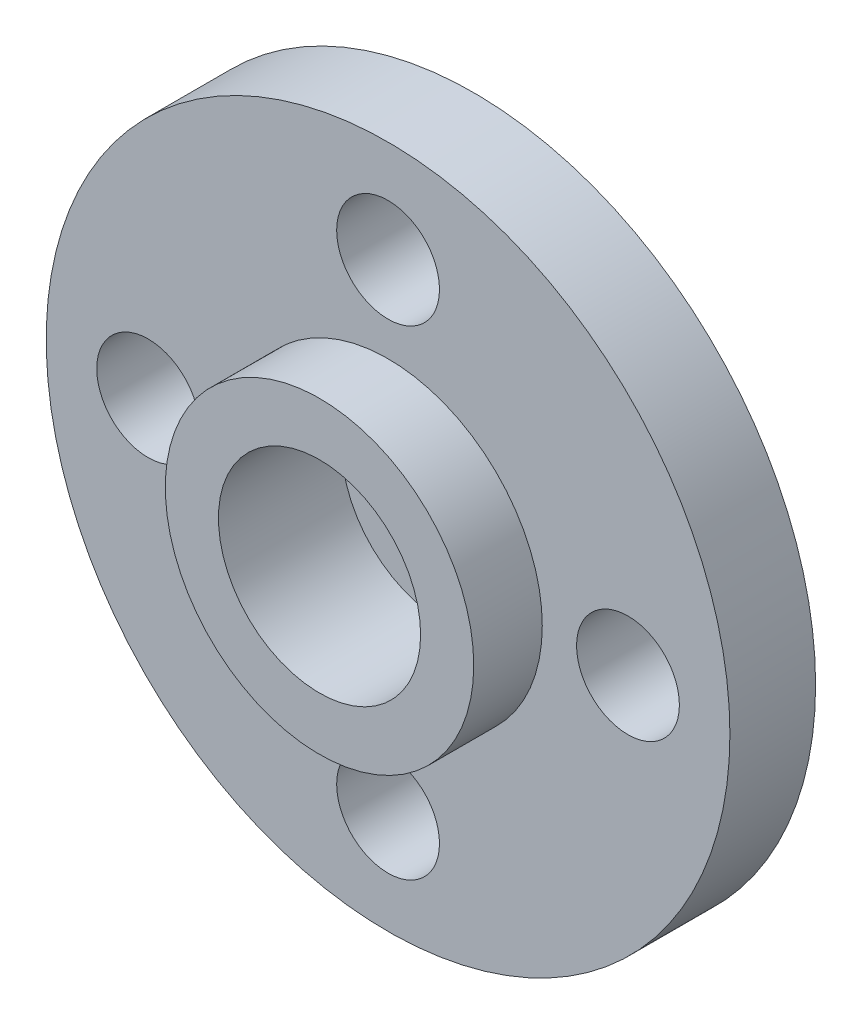
ISO-10303-21;
HEADER;
FILE_DESCRIPTION(('STEP AP214'),'2;1');
FILE_NAME('part.step','',(''),(''),'','','');
FILE_SCHEMA(('AUTOMOTIVE_DESIGN { 1 0 10303 214 1 1 1 1 }'));
ENDSEC;
DATA;
#1=APPLICATION_CONTEXT('core data for automotive mechanical design processes');
#2=APPLICATION_PROTOCOL_DEFINITION('international standard','automotive_design',2000,#1);
#3=PRODUCT_CONTEXT('',#1,'mechanical');
#4=PRODUCT('Part','Part','',(#3));
#5=PRODUCT_RELATED_PRODUCT_CATEGORY('part','',(#4));
#6=PRODUCT_DEFINITION_FORMATION('','',#4);
#7=PRODUCT_DEFINITION_CONTEXT('part definition',#1,'design');
#8=PRODUCT_DEFINITION('design','',#6,#7);
#9=PRODUCT_DEFINITION_SHAPE('','',#8);
#10=(LENGTH_UNIT() NAMED_UNIT(*) SI_UNIT(.MILLI.,.METRE.));
#11=(NAMED_UNIT(*) PLANE_ANGLE_UNIT() SI_UNIT($,.RADIAN.));
#12=(NAMED_UNIT(*) SI_UNIT($,.STERADIAN.) SOLID_ANGLE_UNIT());
#13=UNCERTAINTY_MEASURE_WITH_UNIT(LENGTH_MEASURE(1.E-05),#10,'distance_accuracy_value','');
#14=(GEOMETRIC_REPRESENTATION_CONTEXT(3) GLOBAL_UNCERTAINTY_ASSIGNED_CONTEXT((#13)) GLOBAL_UNIT_ASSIGNED_CONTEXT((#10,
#11,#12)) REPRESENTATION_CONTEXT('',''));
#15=CARTESIAN_POINT('',(0.,0.,0.));
#16=DIRECTION('',(0.,0.,1.));
#17=DIRECTION('',(1.,0.,0.));
#18=AXIS2_PLACEMENT_3D('',#15,#16,#17);
#19=CARTESIAN_POINT('',(0.,0.,-0.899999999999998));
#20=DIRECTION('',(0.,0.,1.));
#21=DIRECTION('',(1.,0.,0.));
#22=AXIS2_PLACEMENT_3D('',#19,#20,#21);
#23=PLANE('',#22);
#24=CARTESIAN_POINT('',(0.,0.,-0.899999999999998));
#25=DIRECTION('',(0.,0.,1.));
#26=DIRECTION('',(1.,0.,0.));
#27=AXIS2_PLACEMENT_3D('',#24,#25,#26);
#28=CIRCLE('',#27,1.6);
#29=CARTESIAN_POINT('',(1.6,0.,-0.899999999999998));
#30=VERTEX_POINT('',#29);
#31=EDGE_CURVE('E80',#30,#30,#28,.T.);
#32=ORIENTED_EDGE('',*,*,#31,.T.);
#33=EDGE_LOOP('',(#32));
#34=FACE_BOUND('',#33,.T.);
#35=CARTESIAN_POINT('',(0.,0.,-0.899999999999998));
#36=DIRECTION('',(0.,0.,1.));
#37=DIRECTION('',(1.,0.,0.));
#38=AXIS2_PLACEMENT_3D('',#35,#36,#37);
#39=CIRCLE('',#38,9.975);
#40=CARTESIAN_POINT('',(9.975,0.,-0.899999999999998));
#41=VERTEX_POINT('',#40);
#42=EDGE_CURVE('E75',#41,#41,#39,.T.);
#43=ORIENTED_EDGE('',*,*,#42,.F.);
#44=EDGE_LOOP('',(#43));
#45=FACE_BOUND('',#44,.T.);
#46=CARTESIAN_POINT('',(7.,0.,-0.899999999999999));
#47=DIRECTION('',(0.,0.,-1.));
#48=DIRECTION('',(-1.,0.,0.));
#49=AXIS2_PLACEMENT_3D('',#46,#47,#48);
#50=CIRCLE('',#49,1.49999999999999);
#51=CARTESIAN_POINT('',(5.50000000000001,0.,-0.899999999999999));
#52=VERTEX_POINT('',#51);
#53=EDGE_CURVE('E95',#52,#52,#50,.T.);
#54=ORIENTED_EDGE('',*,*,#53,.F.);
#55=EDGE_LOOP('',(#54));
#56=FACE_BOUND('',#55,.T.);
#57=CARTESIAN_POINT('',(0.,-7.,-0.899999999999999));
#58=DIRECTION('',(0.,0.,-1.));
#59=DIRECTION('',(-1.,0.,0.));
#60=AXIS2_PLACEMENT_3D('',#57,#58,#59);
#61=CIRCLE('',#60,1.49999999999999);
#62=CARTESIAN_POINT('',(-1.49999999999999,-7.,-0.899999999999999));
#63=VERTEX_POINT('',#62);
#64=EDGE_CURVE('E103',#63,#63,#61,.T.);
#65=ORIENTED_EDGE('',*,*,#64,.F.);
#66=EDGE_LOOP('',(#65));
#67=FACE_BOUND('',#66,.T.);
#68=CARTESIAN_POINT('',(-7.,0.,-0.899999999999999));
#69=DIRECTION('',(0.,0.,-1.));
#70=DIRECTION('',(-1.,0.,0.));
#71=AXIS2_PLACEMENT_3D('',#68,#69,#70);
#72=CIRCLE('',#71,1.49999999999999);
#73=CARTESIAN_POINT('',(-8.49999999999999,0.,-0.899999999999999));
#74=VERTEX_POINT('',#73);
#75=EDGE_CURVE('E111',#74,#74,#72,.T.);
#76=ORIENTED_EDGE('',*,*,#75,.F.);
#77=EDGE_LOOP('',(#76));
#78=FACE_BOUND('',#77,.T.);
#79=CARTESIAN_POINT('',(0.,7.,-0.899999999999999));
#80=DIRECTION('',(0.,0.,-1.));
#81=DIRECTION('',(-1.,0.,0.));
#82=AXIS2_PLACEMENT_3D('',#79,#80,#81);
#83=CIRCLE('',#82,1.49999999999999);
#84=CARTESIAN_POINT('',(-1.49999999999999,7.,-0.899999999999999));
#85=VERTEX_POINT('',#84);
#86=EDGE_CURVE('E119',#85,#85,#83,.T.);
#87=ORIENTED_EDGE('',*,*,#86,.F.);
#88=EDGE_LOOP('',(#87));
#89=FACE_BOUND('',#88,.T.);
#90=ADVANCED_FACE('F55',(#34,#45,#56,#67,#78,#89),#23,.F.);
#91=CARTESIAN_POINT('',(0.,0.,-0.899999999999998));
#92=DIRECTION('',(0.,0.,1.));
#93=DIRECTION('',(1.,0.,0.));
#94=AXIS2_PLACEMENT_3D('',#91,#92,#93);
#95=CYLINDRICAL_SURFACE('',#94,1.6);
#96=ORIENTED_EDGE('',*,*,#31,.F.);
#97=EDGE_LOOP('',(#96));
#98=FACE_BOUND('',#97,.T.);
#99=CARTESIAN_POINT('',(0.,0.,0.));
#100=DIRECTION('',(0.,0.,1.));
#101=DIRECTION('',(1.,0.,0.));
#102=AXIS2_PLACEMENT_3D('',#99,#100,#101);
#103=CIRCLE('',#102,1.6);
#104=CARTESIAN_POINT('',(1.6,0.,0.));
#105=VERTEX_POINT('',#104);
#106=EDGE_CURVE('E59',#105,#105,#103,.F.);
#107=ORIENTED_EDGE('',*,*,#106,.F.);
#108=EDGE_LOOP('',(#107));
#109=FACE_BOUND('',#108,.T.);
#110=ADVANCED_FACE('F128',(#98,#109),#95,.F.);
#111=CARTESIAN_POINT('',(0.,0.,3.6));
#112=DIRECTION('',(0.,0.,1.));
#113=DIRECTION('',(1.,0.,0.));
#114=AXIS2_PLACEMENT_3D('',#111,#112,#113);
#115=PLANE('',#114);
#116=CARTESIAN_POINT('',(0.,0.,3.6));
#117=DIRECTION('',(0.,0.,1.));
#118=DIRECTION('',(1.,0.,0.));
#119=AXIS2_PLACEMENT_3D('',#116,#117,#118);
#120=CIRCLE('',#119,4.5);
#121=CARTESIAN_POINT('',(4.5,0.,3.6));
#122=VERTEX_POINT('',#121);
#123=EDGE_CURVE('E11',#122,#122,#120,.T.);
#124=ORIENTED_EDGE('',*,*,#123,.T.);
#125=EDGE_LOOP('',(#124));
#126=FACE_BOUND('',#125,.T.);
#127=CARTESIAN_POINT('',(0.,0.,3.6));
#128=DIRECTION('',(0.,0.,1.));
#129=DIRECTION('',(1.,0.,0.));
#130=AXIS2_PLACEMENT_3D('',#127,#128,#129);
#131=CIRCLE('',#130,2.95);
#132=CARTESIAN_POINT('',(2.95,0.,3.6));
#133=VERTEX_POINT('',#132);
#134=EDGE_CURVE('E64',#133,#133,#131,.T.);
#135=ORIENTED_EDGE('',*,*,#134,.F.);
#136=EDGE_LOOP('',(#135));
#137=FACE_BOUND('',#136,.T.);
#138=ADVANCED_FACE('F136',(#126,#137),#115,.T.);
#139=CARTESIAN_POINT('',(0.,0.,3.6));
#140=DIRECTION('',(0.,0.,-1.));
#141=DIRECTION('',(-1.,0.,0.));
#142=AXIS2_PLACEMENT_3D('',#139,#140,#141);
#143=CYLINDRICAL_SURFACE('',#142,4.5);
#144=CARTESIAN_POINT('',(0.,0.,1.6));
#145=DIRECTION('',(0.,0.,1.));
#146=DIRECTION('',(1.,0.,0.));
#147=AXIS2_PLACEMENT_3D('',#144,#145,#146);
#148=CIRCLE('',#147,4.5);
#149=CARTESIAN_POINT('',(4.5,0.,1.6));
#150=VERTEX_POINT('',#149);
#151=EDGE_CURVE('E69',#150,#150,#148,.T.);
#152=ORIENTED_EDGE('',*,*,#151,.T.);
#153=EDGE_LOOP('',(#152));
#154=FACE_BOUND('',#153,.T.);
#155=ORIENTED_EDGE('',*,*,#123,.F.);
#156=EDGE_LOOP('',(#155));
#157=FACE_BOUND('',#156,.T.);
#158=ADVANCED_FACE('F57',(#154,#157),#143,.T.);
#159=CARTESIAN_POINT('',(0.,0.,3.6));
#160=DIRECTION('',(0.,0.,-1.));
#161=DIRECTION('',(-1.,0.,0.));
#162=AXIS2_PLACEMENT_3D('',#159,#160,#161);
#163=CYLINDRICAL_SURFACE('',#162,2.95);
#164=ORIENTED_EDGE('',*,*,#134,.T.);
#165=EDGE_LOOP('',(#164));
#166=FACE_BOUND('',#165,.T.);
#167=CARTESIAN_POINT('',(0.,0.,0.));
#168=DIRECTION('',(0.,0.,1.));
#169=DIRECTION('',(1.,0.,0.));
#170=AXIS2_PLACEMENT_3D('',#167,#168,#169);
#171=CIRCLE('',#170,2.95);
#172=CARTESIAN_POINT('',(2.95,0.,0.));
#173=VERTEX_POINT('',#172);
#174=EDGE_CURVE('E87',#173,#173,#171,.T.);
#175=ORIENTED_EDGE('',*,*,#174,.F.);
#176=EDGE_LOOP('',(#175));
#177=FACE_BOUND('',#176,.T.);
#178=ADVANCED_FACE('F149',(#166,#177),#163,.F.);
#179=CARTESIAN_POINT('',(0.,0.,-0.899999999999998));
#180=DIRECTION('',(0.,0.,1.));
#181=DIRECTION('',(1.,0.,0.));
#182=AXIS2_PLACEMENT_3D('',#179,#180,#181);
#183=CYLINDRICAL_SURFACE('',#182,9.975);
#184=ORIENTED_EDGE('',*,*,#42,.T.);
#185=EDGE_LOOP('',(#184));
#186=FACE_BOUND('',#185,.T.);
#187=CARTESIAN_POINT('',(0.,0.,1.6));
#188=DIRECTION('',(0.,0.,1.));
#189=DIRECTION('',(1.,0.,0.));
#190=AXIS2_PLACEMENT_3D('',#187,#188,#189);
#191=CIRCLE('',#190,9.975);
#192=CARTESIAN_POINT('',(9.975,0.,1.6));
#193=VERTEX_POINT('',#192);
#194=EDGE_CURVE('E76',#193,#193,#191,.T.);
#195=ORIENTED_EDGE('',*,*,#194,.F.);
#196=EDGE_LOOP('',(#195));
#197=FACE_BOUND('',#196,.T.);
#198=ADVANCED_FACE('F145',(#186,#197),#183,.T.);
#199=CARTESIAN_POINT('',(0.,0.,1.6));
#200=DIRECTION('',(0.,0.,1.));
#201=DIRECTION('',(1.,0.,0.));
#202=AXIS2_PLACEMENT_3D('',#199,#200,#201);
#203=PLANE('',#202);
#204=CARTESIAN_POINT('',(0.,7.,1.6));
#205=DIRECTION('',(0.,0.,1.));
#206=DIRECTION('',(1.,0.,0.));
#207=AXIS2_PLACEMENT_3D('',#204,#205,#206);
#208=CIRCLE('',#207,1.49999999999999);
#209=CARTESIAN_POINT('',(1.49999999999999,7.,1.6));
#210=VERTEX_POINT('',#209);
#211=EDGE_CURVE('E115',#210,#210,#208,.T.);
#212=ORIENTED_EDGE('',*,*,#211,.F.);
#213=EDGE_LOOP('',(#212));
#214=FACE_BOUND('',#213,.T.);
#215=CARTESIAN_POINT('',(-7.,0.,1.6));
#216=DIRECTION('',(0.,0.,1.));
#217=DIRECTION('',(1.,0.,0.));
#218=AXIS2_PLACEMENT_3D('',#215,#216,#217);
#219=CIRCLE('',#218,1.49999999999999);
#220=CARTESIAN_POINT('',(-5.50000000000001,0.,1.6));
#221=VERTEX_POINT('',#220);
#222=EDGE_CURVE('E107',#221,#221,#219,.T.);
#223=ORIENTED_EDGE('',*,*,#222,.F.);
#224=EDGE_LOOP('',(#223));
#225=FACE_BOUND('',#224,.T.);
#226=CARTESIAN_POINT('',(0.,-7.,1.6));
#227=DIRECTION('',(0.,0.,1.));
#228=DIRECTION('',(1.,0.,0.));
#229=AXIS2_PLACEMENT_3D('',#226,#227,#228);
#230=CIRCLE('',#229,1.49999999999999);
#231=CARTESIAN_POINT('',(1.49999999999999,-7.,1.6));
#232=VERTEX_POINT('',#231);
#233=EDGE_CURVE('E99',#232,#232,#230,.T.);
#234=ORIENTED_EDGE('',*,*,#233,.F.);
#235=EDGE_LOOP('',(#234));
#236=FACE_BOUND('',#235,.T.);
#237=CARTESIAN_POINT('',(7.,0.,1.6));
#238=DIRECTION('',(0.,0.,1.));
#239=DIRECTION('',(1.,0.,0.));
#240=AXIS2_PLACEMENT_3D('',#237,#238,#239);
#241=CIRCLE('',#240,1.49999999999999);
#242=CARTESIAN_POINT('',(8.49999999999999,0.,1.6));
#243=VERTEX_POINT('',#242);
#244=EDGE_CURVE('E91',#243,#243,#241,.T.);
#245=ORIENTED_EDGE('',*,*,#244,.F.);
#246=EDGE_LOOP('',(#245));
#247=FACE_BOUND('',#246,.T.);
#248=ORIENTED_EDGE('',*,*,#151,.F.);
#249=EDGE_LOOP('',(#248));
#250=FACE_BOUND('',#249,.T.);
#251=ORIENTED_EDGE('',*,*,#194,.T.);
#252=EDGE_LOOP('',(#251));
#253=FACE_BOUND('',#252,.T.);
#254=ADVANCED_FACE('F142',(#214,#225,#236,#247,#250,#253),#203,.T.);
#255=CARTESIAN_POINT('',(0.,0.,0.));
#256=DIRECTION('',(0.,0.,1.));
#257=DIRECTION('',(1.,0.,0.));
#258=AXIS2_PLACEMENT_3D('',#255,#256,#257);
#259=PLANE('',#258);
#260=ORIENTED_EDGE('',*,*,#174,.T.);
#261=EDGE_LOOP('',(#260));
#262=FACE_BOUND('',#261,.T.);
#263=ORIENTED_EDGE('',*,*,#106,.T.);
#264=EDGE_LOOP('',(#263));
#265=FACE_BOUND('',#264,.T.);
#266=ADVANCED_FACE('F144',(#262,#265),#259,.T.);
#267=CARTESIAN_POINT('',(7.,0.,-0.899999999999998));
#268=DIRECTION('',(0.,0.,-1.));
#269=DIRECTION('',(-1.,0.,0.));
#270=AXIS2_PLACEMENT_3D('',#267,#268,#269);
#271=CYLINDRICAL_SURFACE('',#270,1.49999999999999);
#272=ORIENTED_EDGE('',*,*,#53,.T.);
#273=EDGE_LOOP('',(#272));
#274=FACE_BOUND('',#273,.T.);
#275=ORIENTED_EDGE('',*,*,#244,.T.);
#276=EDGE_LOOP('',(#275));
#277=FACE_BOUND('',#276,.T.);
#278=ADVANCED_FACE('F164',(#274,#277),#271,.F.);
#279=CARTESIAN_POINT('',(0.,-7.,-0.899999999999998));
#280=DIRECTION('',(0.,0.,-1.));
#281=DIRECTION('',(-1.,0.,0.));
#282=AXIS2_PLACEMENT_3D('',#279,#280,#281);
#283=CYLINDRICAL_SURFACE('',#282,1.49999999999999);
#284=ORIENTED_EDGE('',*,*,#64,.T.);
#285=EDGE_LOOP('',(#284));
#286=FACE_BOUND('',#285,.T.);
#287=ORIENTED_EDGE('',*,*,#233,.T.);
#288=EDGE_LOOP('',(#287));
#289=FACE_BOUND('',#288,.T.);
#290=ADVANCED_FACE('F172',(#286,#289),#283,.F.);
#291=CARTESIAN_POINT('',(-7.,0.,-0.899999999999998));
#292=DIRECTION('',(0.,0.,-1.));
#293=DIRECTION('',(-1.,0.,0.));
#294=AXIS2_PLACEMENT_3D('',#291,#292,#293);
#295=CYLINDRICAL_SURFACE('',#294,1.49999999999999);
#296=ORIENTED_EDGE('',*,*,#75,.T.);
#297=EDGE_LOOP('',(#296));
#298=FACE_BOUND('',#297,.T.);
#299=ORIENTED_EDGE('',*,*,#222,.T.);
#300=EDGE_LOOP('',(#299));
#301=FACE_BOUND('',#300,.T.);
#302=ADVANCED_FACE('F178',(#298,#301),#295,.F.);
#303=CARTESIAN_POINT('',(0.,7.,-0.899999999999998));
#304=DIRECTION('',(0.,0.,-1.));
#305=DIRECTION('',(-1.,0.,0.));
#306=AXIS2_PLACEMENT_3D('',#303,#304,#305);
#307=CYLINDRICAL_SURFACE('',#306,1.49999999999999);
#308=ORIENTED_EDGE('',*,*,#86,.T.);
#309=EDGE_LOOP('',(#308));
#310=FACE_BOUND('',#309,.T.);
#311=ORIENTED_EDGE('',*,*,#211,.T.);
#312=EDGE_LOOP('',(#311));
#313=FACE_BOUND('',#312,.T.);
#314=ADVANCED_FACE('F124',(#310,#313),#307,.F.);
#315=CLOSED_SHELL('',(#90,#110,#138,#158,#178,#198,#254,#266,#278,#290,#302,#314));
#316=MANIFOLD_SOLID_BREP('B2',#315);
#317=ADVANCED_BREP_SHAPE_REPRESENTATION('',(#18,#316),#14);
#318=SHAPE_DEFINITION_REPRESENTATION(#9,#317);
ENDSEC;
END-ISO-10303-21;
